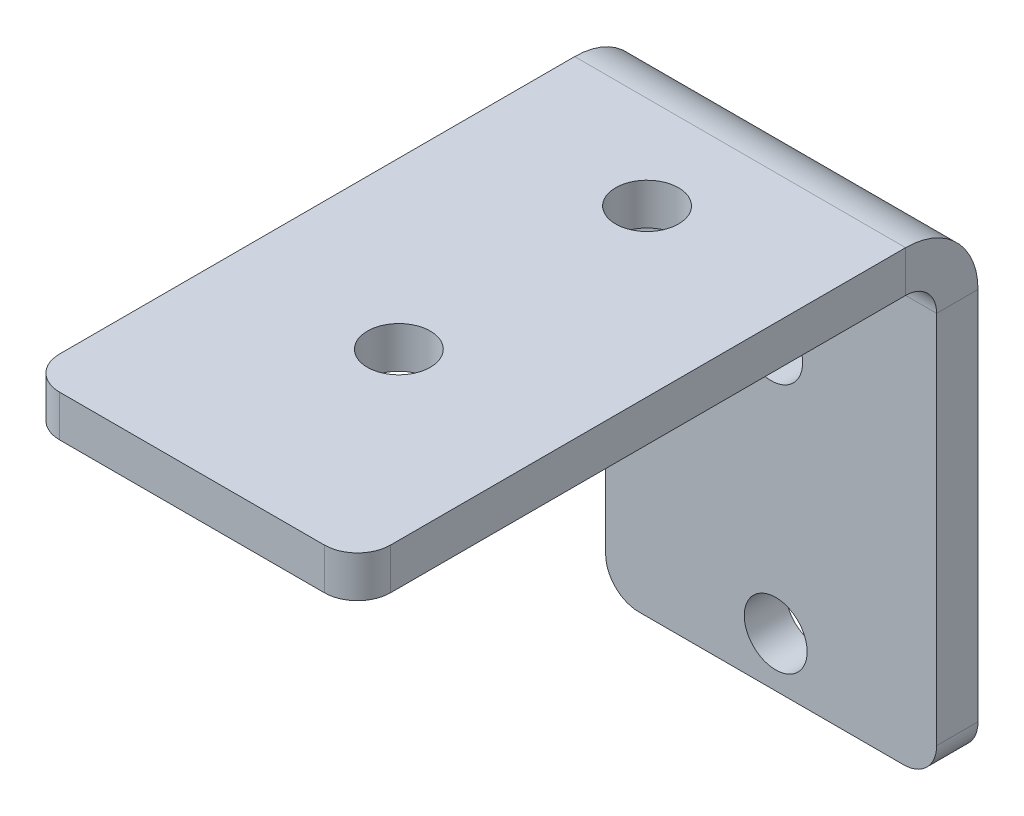
ISO-10303-21;
HEADER;
FILE_DESCRIPTION(('STEP AP214'),'2;1');
FILE_NAME('part.step','',(''),(''),'','','');
FILE_SCHEMA(('AUTOMOTIVE_DESIGN { 1 0 10303 214 1 1 1 1 }'));
ENDSEC;
DATA;
#1=APPLICATION_CONTEXT('core data for automotive mechanical design processes');
#2=APPLICATION_PROTOCOL_DEFINITION('international standard','automotive_design',2000,#1);
#3=PRODUCT_CONTEXT('',#1,'mechanical');
#4=PRODUCT('Part','Part','',(#3));
#5=PRODUCT_RELATED_PRODUCT_CATEGORY('part','',(#4));
#6=PRODUCT_DEFINITION_FORMATION('','',#4);
#7=PRODUCT_DEFINITION_CONTEXT('part definition',#1,'design');
#8=PRODUCT_DEFINITION('design','',#6,#7);
#9=PRODUCT_DEFINITION_SHAPE('','',#8);
#10=(LENGTH_UNIT() NAMED_UNIT(*) SI_UNIT(.MILLI.,.METRE.));
#11=(NAMED_UNIT(*) PLANE_ANGLE_UNIT() SI_UNIT($,.RADIAN.));
#12=(NAMED_UNIT(*) SI_UNIT($,.STERADIAN.) SOLID_ANGLE_UNIT());
#13=UNCERTAINTY_MEASURE_WITH_UNIT(LENGTH_MEASURE(1.E-05),#10,'distance_accuracy_value','');
#14=(GEOMETRIC_REPRESENTATION_CONTEXT(3) GLOBAL_UNCERTAINTY_ASSIGNED_CONTEXT((#13)) GLOBAL_UNIT_ASSIGNED_CONTEXT((#10,
#11,#12)) REPRESENTATION_CONTEXT('',''));
#15=CARTESIAN_POINT('',(0.,0.,0.));
#16=DIRECTION('',(0.,0.,1.));
#17=DIRECTION('',(1.,0.,0.));
#18=AXIS2_PLACEMENT_3D('',#15,#16,#17);
#19=CARTESIAN_POINT('',(12.7,15.24,47.625));
#20=DIRECTION('',(1.,0.,0.));
#21=DIRECTION('',(0.,0.,-1.));
#22=AXIS2_PLACEMENT_3D('',#19,#20,#21);
#23=PLANE('',#22);
#24=DIRECTION('',(0.,-1.,0.));
#25=VECTOR('',#24,1.);
#26=CARTESIAN_POINT('',(12.7,15.24,5.555000066));
#27=LINE('',#26,#25);
#28=CARTESIAN_POINT('',(12.7,18.415,5.555000066));
#29=VERTEX_POINT('',#28);
#30=CARTESIAN_POINT('',(12.7,15.24,5.555000066));
#31=VERTEX_POINT('',#30);
#32=EDGE_CURVE('E11',#29,#31,#27,.T.);
#33=ORIENTED_EDGE('',*,*,#32,.F.);
#34=DIRECTION('',(0.,0.,1.));
#35=VECTOR('',#34,1.);
#36=CARTESIAN_POINT('',(12.7,18.415,47.625));
#37=LINE('',#36,#35);
#38=CARTESIAN_POINT('',(12.7,18.415,45.085));
#39=VERTEX_POINT('',#38);
#40=EDGE_CURVE('E101',#39,#29,#37,.F.);
#41=ORIENTED_EDGE('',*,*,#40,.F.);
#42=DIRECTION('',(0.,-1.,0.));
#43=VECTOR('',#42,1.);
#44=CARTESIAN_POINT('',(12.7,15.24,45.085));
#45=LINE('',#44,#43);
#46=CARTESIAN_POINT('',(12.7,15.24,45.085));
#47=VERTEX_POINT('',#46);
#48=EDGE_CURVE('E49',#39,#47,#45,.T.);
#49=ORIENTED_EDGE('',*,*,#48,.T.);
#50=DIRECTION('',(0.,0.,-1.));
#51=VECTOR('',#50,1.);
#52=CARTESIAN_POINT('',(12.7,15.24,47.625));
#53=LINE('',#52,#51);
#54=EDGE_CURVE('E104',#47,#31,#53,.T.);
#55=ORIENTED_EDGE('',*,*,#54,.T.);
#56=EDGE_LOOP('',(#33,#41,#49,#55));
#57=FACE_BOUND('',#56,.T.);
#58=ADVANCED_FACE('F39',(#57),#23,.T.);
#59=CARTESIAN_POINT('',(10.16,15.24,45.085));
#60=DIRECTION('',(0.,1.,0.));
#61=DIRECTION('',(-1.,0.,0.));
#62=AXIS2_PLACEMENT_3D('',#59,#60,#61);
#63=CYLINDRICAL_SURFACE('',#62,2.54);
#64=ORIENTED_EDGE('',*,*,#48,.F.);
#65=CARTESIAN_POINT('',(10.16,18.415,45.085));
#66=DIRECTION('',(0.,1.,0.));
#67=DIRECTION('',(-1.,0.,0.));
#68=AXIS2_PLACEMENT_3D('',#65,#66,#67);
#69=CIRCLE('',#68,2.54);
#70=CARTESIAN_POINT('',(10.16,18.415,47.625));
#71=VERTEX_POINT('',#70);
#72=EDGE_CURVE('E130',#39,#71,#69,.F.);
#73=ORIENTED_EDGE('',*,*,#72,.T.);
#74=DIRECTION('',(0.,-1.,0.));
#75=VECTOR('',#74,1.);
#76=CARTESIAN_POINT('',(10.16,15.24,47.625));
#77=LINE('',#76,#75);
#78=CARTESIAN_POINT('',(10.16,15.24,47.625));
#79=VERTEX_POINT('',#78);
#80=EDGE_CURVE('E167',#71,#79,#77,.T.);
#81=ORIENTED_EDGE('',*,*,#80,.T.);
#82=CARTESIAN_POINT('',(10.16,15.24,45.085));
#83=DIRECTION('',(0.,1.,0.));
#84=DIRECTION('',(-1.,0.,0.));
#85=AXIS2_PLACEMENT_3D('',#82,#83,#84);
#86=CIRCLE('',#85,2.54);
#87=EDGE_CURVE('E179',#47,#79,#86,.F.);
#88=ORIENTED_EDGE('',*,*,#87,.F.);
#89=EDGE_LOOP('',(#64,#73,#81,#88));
#90=FACE_BOUND('',#89,.T.);
#91=ADVANCED_FACE('F185',(#90),#63,.T.);
#92=CARTESIAN_POINT('',(-12.7,15.24,47.625));
#93=DIRECTION('',(0.,0.,1.));
#94=DIRECTION('',(1.,0.,0.));
#95=AXIS2_PLACEMENT_3D('',#92,#93,#94);
#96=PLANE('',#95);
#97=ORIENTED_EDGE('',*,*,#80,.F.);
#98=DIRECTION('',(-1.,0.,0.));
#99=VECTOR('',#98,1.);
#100=CARTESIAN_POINT('',(-12.7,18.415,47.625));
#101=LINE('',#100,#99);
#102=CARTESIAN_POINT('',(-10.16,18.415,47.625));
#103=VERTEX_POINT('',#102);
#104=EDGE_CURVE('E251',#103,#71,#101,.F.);
#105=ORIENTED_EDGE('',*,*,#104,.F.);
#106=DIRECTION('',(0.,-1.,0.));
#107=VECTOR('',#106,1.);
#108=CARTESIAN_POINT('',(-10.16,15.24,47.625));
#109=LINE('',#108,#107);
#110=CARTESIAN_POINT('',(-10.16,15.24,47.625));
#111=VERTEX_POINT('',#110);
#112=EDGE_CURVE('E164',#103,#111,#109,.T.);
#113=ORIENTED_EDGE('',*,*,#112,.T.);
#114=DIRECTION('',(1.,0.,0.));
#115=VECTOR('',#114,1.);
#116=CARTESIAN_POINT('',(-12.7,15.24,47.625));
#117=LINE('',#116,#115);
#118=EDGE_CURVE('E186',#111,#79,#117,.T.);
#119=ORIENTED_EDGE('',*,*,#118,.T.);
#120=EDGE_LOOP('',(#97,#105,#113,#119));
#121=FACE_BOUND('',#120,.T.);
#122=ADVANCED_FACE('F255',(#121),#96,.T.);
#123=CARTESIAN_POINT('',(-10.16,15.24,45.085));
#124=DIRECTION('',(0.,1.,0.));
#125=DIRECTION('',(-1.,0.,0.));
#126=AXIS2_PLACEMENT_3D('',#123,#124,#125);
#127=CYLINDRICAL_SURFACE('',#126,2.54);
#128=ORIENTED_EDGE('',*,*,#112,.F.);
#129=CARTESIAN_POINT('',(-10.16,18.415,45.085));
#130=DIRECTION('',(0.,1.,0.));
#131=DIRECTION('',(-1.,0.,0.));
#132=AXIS2_PLACEMENT_3D('',#129,#130,#131);
#133=CIRCLE('',#132,2.54);
#134=CARTESIAN_POINT('',(-12.7,18.415,45.085));
#135=VERTEX_POINT('',#134);
#136=EDGE_CURVE('E248',#103,#135,#133,.F.);
#137=ORIENTED_EDGE('',*,*,#136,.T.);
#138=DIRECTION('',(0.,-1.,0.));
#139=VECTOR('',#138,1.);
#140=CARTESIAN_POINT('',(-12.7,15.24,45.085));
#141=LINE('',#140,#139);
#142=CARTESIAN_POINT('',(-12.7,15.24,45.085));
#143=VERTEX_POINT('',#142);
#144=EDGE_CURVE('E161',#135,#143,#141,.T.);
#145=ORIENTED_EDGE('',*,*,#144,.T.);
#146=CARTESIAN_POINT('',(-10.16,15.24,45.085));
#147=DIRECTION('',(0.,1.,0.));
#148=DIRECTION('',(-1.,0.,0.));
#149=AXIS2_PLACEMENT_3D('',#146,#147,#148);
#150=CIRCLE('',#149,2.54);
#151=EDGE_CURVE('E188',#111,#143,#150,.F.);
#152=ORIENTED_EDGE('',*,*,#151,.F.);
#153=EDGE_LOOP('',(#128,#137,#145,#152));
#154=FACE_BOUND('',#153,.T.);
#155=ADVANCED_FACE('F263',(#154),#127,.T.);
#156=CARTESIAN_POINT('',(-12.7,15.24,47.625));
#157=DIRECTION('',(1.,0.,0.));
#158=DIRECTION('',(0.,0.,-1.));
#159=AXIS2_PLACEMENT_3D('',#156,#157,#158);
#160=PLANE('',#159);
#161=ORIENTED_EDGE('',*,*,#144,.F.);
#162=DIRECTION('',(0.,0.,1.));
#163=VECTOR('',#162,1.);
#164=CARTESIAN_POINT('',(-12.7,18.415,47.625));
#165=LINE('',#164,#163);
#166=CARTESIAN_POINT('',(-12.7,18.415,5.555000066));
#167=VERTEX_POINT('',#166);
#168=EDGE_CURVE('E231',#135,#167,#165,.F.);
#169=ORIENTED_EDGE('',*,*,#168,.T.);
#170=DIRECTION('',(0.,-1.,0.));
#171=VECTOR('',#170,1.);
#172=CARTESIAN_POINT('',(-12.7,15.24,5.555000066));
#173=LINE('',#172,#171);
#174=CARTESIAN_POINT('',(-12.7,15.24,5.555000066));
#175=VERTEX_POINT('',#174);
#176=EDGE_CURVE('E158',#167,#175,#173,.T.);
#177=ORIENTED_EDGE('',*,*,#176,.T.);
#178=DIRECTION('',(0.,0.,-1.));
#179=VECTOR('',#178,1.);
#180=CARTESIAN_POINT('',(-12.7,15.24,47.625));
#181=LINE('',#180,#179);
#182=EDGE_CURVE('E194',#143,#175,#181,.T.);
#183=ORIENTED_EDGE('',*,*,#182,.F.);
#184=EDGE_LOOP('',(#161,#169,#177,#183));
#185=FACE_BOUND('',#184,.T.);
#186=ADVANCED_FACE('F267',(#185),#160,.F.);
#187=CARTESIAN_POINT('',(-12.7,12.859999934,5.555000066));
#188=DIRECTION('',(-1.,0.,0.));
#189=DIRECTION('',(0.,0.,1.));
#190=AXIS2_PLACEMENT_3D('',#187,#188,#189);
#191=PLANE('',#190);
#192=ORIENTED_EDGE('',*,*,#176,.F.);
#193=CARTESIAN_POINT('',(-12.7,12.859999934,5.555000066));
#194=DIRECTION('',(-1.,0.,0.));
#195=DIRECTION('',(0.,-1.,0.));
#196=AXIS2_PLACEMENT_3D('',#193,#194,#195);
#197=CIRCLE('',#196,5.555000066);
#198=CARTESIAN_POINT('',(-12.7,12.859999934,0.));
#199=VERTEX_POINT('',#198);
#200=EDGE_CURVE('E119',#167,#199,#197,.T.);
#201=ORIENTED_EDGE('',*,*,#200,.T.);
#202=DIRECTION('',(0.,0.,1.));
#203=VECTOR('',#202,1.);
#204=CARTESIAN_POINT('',(-12.7,12.859999934,3.175));
#205=LINE('',#204,#203);
#206=CARTESIAN_POINT('',(-12.7,12.859999934,3.175));
#207=VERTEX_POINT('',#206);
#208=EDGE_CURVE('E57',#199,#207,#205,.T.);
#209=ORIENTED_EDGE('',*,*,#208,.T.);
#210=CARTESIAN_POINT('',(-12.7,12.859999934,5.555000066));
#211=DIRECTION('',(1.,0.,0.));
#212=DIRECTION('',(0.,0.,-1.));
#213=AXIS2_PLACEMENT_3D('',#210,#211,#212);
#214=CIRCLE('',#213,2.380000066);
#215=EDGE_CURVE('E223',#175,#207,#214,.F.);
#216=ORIENTED_EDGE('',*,*,#215,.F.);
#217=EDGE_LOOP('',(#192,#201,#209,#216));
#218=FACE_BOUND('',#217,.T.);
#219=ADVANCED_FACE('F268',(#218),#191,.T.);
#220=CARTESIAN_POINT('',(-12.7,-18.415,3.175));
#221=DIRECTION('',(1.,0.,0.));
#222=DIRECTION('',(0.,-1.,0.));
#223=AXIS2_PLACEMENT_3D('',#220,#221,#222);
#224=PLANE('',#223);
#225=ORIENTED_EDGE('',*,*,#208,.F.);
#226=DIRECTION('',(0.,1.,0.));
#227=VECTOR('',#226,1.);
#228=CARTESIAN_POINT('',(-12.7,0.,0.));
#229=LINE('',#228,#227);
#230=CARTESIAN_POINT('',(-12.7,-15.875,0.));
#231=VERTEX_POINT('',#230);
#232=EDGE_CURVE('E237',#199,#231,#229,.F.);
#233=ORIENTED_EDGE('',*,*,#232,.T.);
#234=DIRECTION('',(0.,0.,1.));
#235=VECTOR('',#234,1.);
#236=CARTESIAN_POINT('',(-12.7,-15.875,3.175));
#237=LINE('',#236,#235);
#238=CARTESIAN_POINT('',(-12.7,-15.875,3.175));
#239=VERTEX_POINT('',#238);
#240=EDGE_CURVE('E154',#231,#239,#237,.T.);
#241=ORIENTED_EDGE('',*,*,#240,.T.);
#242=DIRECTION('',(0.,-1.,0.));
#243=VECTOR('',#242,1.);
#244=CARTESIAN_POINT('',(-12.7,-18.415,3.175));
#245=LINE('',#244,#243);
#246=EDGE_CURVE('E211',#207,#239,#245,.T.);
#247=ORIENTED_EDGE('',*,*,#246,.F.);
#248=EDGE_LOOP('',(#225,#233,#241,#247));
#249=FACE_BOUND('',#248,.T.);
#250=ADVANCED_FACE('F301',(#249),#224,.F.);
#251=CARTESIAN_POINT('',(-10.16,-15.875,3.175));
#252=DIRECTION('',(0.,0.,-1.));
#253=DIRECTION('',(-1.,0.,0.));
#254=AXIS2_PLACEMENT_3D('',#251,#252,#253);
#255=CYLINDRICAL_SURFACE('',#254,2.54);
#256=ORIENTED_EDGE('',*,*,#240,.F.);
#257=CARTESIAN_POINT('',(-10.16,-15.875,0.));
#258=DIRECTION('',(0.,0.,-1.));
#259=DIRECTION('',(-1.,0.,0.));
#260=AXIS2_PLACEMENT_3D('',#257,#258,#259);
#261=CIRCLE('',#260,2.54);
#262=CARTESIAN_POINT('',(-10.16,-18.415,0.));
#263=VERTEX_POINT('',#262);
#264=EDGE_CURVE('E124',#231,#263,#261,.F.);
#265=ORIENTED_EDGE('',*,*,#264,.T.);
#266=DIRECTION('',(0.,0.,1.));
#267=VECTOR('',#266,1.);
#268=CARTESIAN_POINT('',(-10.16,-18.415,3.175));
#269=LINE('',#268,#267);
#270=CARTESIAN_POINT('',(-10.16,-18.415,3.175));
#271=VERTEX_POINT('',#270);
#272=EDGE_CURVE('E151',#263,#271,#269,.T.);
#273=ORIENTED_EDGE('',*,*,#272,.T.);
#274=CARTESIAN_POINT('',(-10.16,-15.875,3.175));
#275=DIRECTION('',(0.,0.,-1.));
#276=DIRECTION('',(-1.,0.,0.));
#277=AXIS2_PLACEMENT_3D('',#274,#275,#276);
#278=CIRCLE('',#277,2.54);
#279=EDGE_CURVE('E214',#239,#271,#278,.F.);
#280=ORIENTED_EDGE('',*,*,#279,.F.);
#281=EDGE_LOOP('',(#256,#265,#273,#280));
#282=FACE_BOUND('',#281,.T.);
#283=ADVANCED_FACE('F303',(#282),#255,.T.);
#284=CARTESIAN_POINT('',(-12.7,-18.415,3.175));
#285=DIRECTION('',(0.,1.,0.));
#286=DIRECTION('',(1.,0.,0.));
#287=AXIS2_PLACEMENT_3D('',#284,#285,#286);
#288=PLANE('',#287);
#289=ORIENTED_EDGE('',*,*,#272,.F.);
#290=DIRECTION('',(-1.,0.,0.));
#291=VECTOR('',#290,1.);
#292=CARTESIAN_POINT('',(0.,-18.415,0.));
#293=LINE('',#292,#291);
#294=CARTESIAN_POINT('',(10.16,-18.415,0.));
#295=VERTEX_POINT('',#294);
#296=EDGE_CURVE('E234',#263,#295,#293,.F.);
#297=ORIENTED_EDGE('',*,*,#296,.T.);
#298=DIRECTION('',(0.,0.,1.));
#299=VECTOR('',#298,1.);
#300=CARTESIAN_POINT('',(10.16,-18.415,3.175));
#301=LINE('',#300,#299);
#302=CARTESIAN_POINT('',(10.16,-18.415,3.175));
#303=VERTEX_POINT('',#302);
#304=EDGE_CURVE('E148',#295,#303,#301,.T.);
#305=ORIENTED_EDGE('',*,*,#304,.T.);
#306=DIRECTION('',(1.,0.,0.));
#307=VECTOR('',#306,1.);
#308=CARTESIAN_POINT('',(-12.7,-18.415,3.175));
#309=LINE('',#308,#307);
#310=EDGE_CURVE('E202',#271,#303,#309,.T.);
#311=ORIENTED_EDGE('',*,*,#310,.F.);
#312=EDGE_LOOP('',(#289,#297,#305,#311));
#313=FACE_BOUND('',#312,.T.);
#314=ADVANCED_FACE('F283',(#313),#288,.F.);
#315=CARTESIAN_POINT('',(10.16,-15.875,3.175));
#316=DIRECTION('',(0.,0.,-1.));
#317=DIRECTION('',(-1.,0.,0.));
#318=AXIS2_PLACEMENT_3D('',#315,#316,#317);
#319=CYLINDRICAL_SURFACE('',#318,2.54);
#320=ORIENTED_EDGE('',*,*,#304,.F.);
#321=CARTESIAN_POINT('',(10.16,-15.875,0.));
#322=DIRECTION('',(0.,0.,-1.));
#323=DIRECTION('',(-1.,0.,0.));
#324=AXIS2_PLACEMENT_3D('',#321,#322,#323);
#325=CIRCLE('',#324,2.54);
#326=CARTESIAN_POINT('',(12.7,-15.875,0.));
#327=VERTEX_POINT('',#326);
#328=EDGE_CURVE('E238',#295,#327,#325,.F.);
#329=ORIENTED_EDGE('',*,*,#328,.T.);
#330=DIRECTION('',(0.,0.,1.));
#331=VECTOR('',#330,1.);
#332=CARTESIAN_POINT('',(12.7,-15.875,3.175));
#333=LINE('',#332,#331);
#334=CARTESIAN_POINT('',(12.7,-15.875,3.175));
#335=VERTEX_POINT('',#334);
#336=EDGE_CURVE('E145',#327,#335,#333,.T.);
#337=ORIENTED_EDGE('',*,*,#336,.T.);
#338=CARTESIAN_POINT('',(10.16,-15.875,3.175));
#339=DIRECTION('',(0.,0.,-1.));
#340=DIRECTION('',(-1.,0.,0.));
#341=AXIS2_PLACEMENT_3D('',#338,#339,#340);
#342=CIRCLE('',#341,2.54);
#343=EDGE_CURVE('E205',#303,#335,#342,.F.);
#344=ORIENTED_EDGE('',*,*,#343,.F.);
#345=EDGE_LOOP('',(#320,#329,#337,#344));
#346=FACE_BOUND('',#345,.T.);
#347=ADVANCED_FACE('F292',(#346),#319,.T.);
#348=CARTESIAN_POINT('',(12.7,-18.415,3.175));
#349=DIRECTION('',(-1.,0.,0.));
#350=DIRECTION('',(0.,1.,0.));
#351=AXIS2_PLACEMENT_3D('',#348,#349,#350);
#352=PLANE('',#351);
#353=ORIENTED_EDGE('',*,*,#336,.F.);
#354=DIRECTION('',(0.,1.,0.));
#355=VECTOR('',#354,1.);
#356=CARTESIAN_POINT('',(12.7,0.,0.));
#357=LINE('',#356,#355);
#358=CARTESIAN_POINT('',(12.7,12.859999934,0.));
#359=VERTEX_POINT('',#358);
#360=EDGE_CURVE('E235',#327,#359,#357,.T.);
#361=ORIENTED_EDGE('',*,*,#360,.T.);
#362=DIRECTION('',(0.,0.,1.));
#363=VECTOR('',#362,1.);
#364=CARTESIAN_POINT('',(12.7,12.859999934,3.175));
#365=LINE('',#364,#363);
#366=CARTESIAN_POINT('',(12.7,12.859999934,3.175));
#367=VERTEX_POINT('',#366);
#368=EDGE_CURVE('E43',#359,#367,#365,.T.);
#369=ORIENTED_EDGE('',*,*,#368,.T.);
#370=DIRECTION('',(0.,1.,0.));
#371=VECTOR('',#370,1.);
#372=CARTESIAN_POINT('',(12.7,-18.415,3.175));
#373=LINE('',#372,#371);
#374=EDGE_CURVE('E208',#335,#367,#373,.T.);
#375=ORIENTED_EDGE('',*,*,#374,.F.);
#376=EDGE_LOOP('',(#353,#361,#369,#375));
#377=FACE_BOUND('',#376,.T.);
#378=ADVANCED_FACE('F295',(#377),#352,.F.);
#379=CARTESIAN_POINT('',(0.,15.24,12.7));
#380=DIRECTION('',(0.,1.,0.));
#381=DIRECTION('',(-1.,0.,0.));
#382=AXIS2_PLACEMENT_3D('',#379,#380,#381);
#383=CYLINDRICAL_SURFACE('',#382,2.413);
#384=CARTESIAN_POINT('',(0.,15.24,12.7));
#385=DIRECTION('',(0.,1.,0.));
#386=DIRECTION('',(-1.,0.,0.));
#387=AXIS2_PLACEMENT_3D('',#384,#385,#386);
#388=CIRCLE('',#387,2.413);
#389=CARTESIAN_POINT('',(-2.413,15.24,12.7));
#390=VERTEX_POINT('',#389);
#391=EDGE_CURVE('E225',#390,#390,#388,.T.);
#392=ORIENTED_EDGE('',*,*,#391,.F.);
#393=EDGE_LOOP('',(#392));
#394=FACE_BOUND('',#393,.T.);
#395=CARTESIAN_POINT('',(0.,18.415,12.7));
#396=DIRECTION('',(0.,1.,0.));
#397=DIRECTION('',(-1.,0.,0.));
#398=AXIS2_PLACEMENT_3D('',#395,#396,#397);
#399=CIRCLE('',#398,2.413);
#400=CARTESIAN_POINT('',(-2.413,18.415,12.7));
#401=VERTEX_POINT('',#400);
#402=EDGE_CURVE('E137',#401,#401,#399,.T.);
#403=ORIENTED_EDGE('',*,*,#402,.T.);
#404=EDGE_LOOP('',(#403));
#405=FACE_BOUND('',#404,.T.);
#406=ADVANCED_FACE('F322',(#394,#405),#383,.F.);
#407=CARTESIAN_POINT('',(0.,15.24,31.75));
#408=DIRECTION('',(0.,1.,0.));
#409=DIRECTION('',(-1.,0.,0.));
#410=AXIS2_PLACEMENT_3D('',#407,#408,#409);
#411=CYLINDRICAL_SURFACE('',#410,2.413);
#412=CARTESIAN_POINT('',(0.,15.24,31.75));
#413=DIRECTION('',(0.,1.,0.));
#414=DIRECTION('',(-1.,0.,0.));
#415=AXIS2_PLACEMENT_3D('',#412,#413,#414);
#416=CIRCLE('',#415,2.413);
#417=CARTESIAN_POINT('',(-2.413,15.24,31.75));
#418=VERTEX_POINT('',#417);
#419=EDGE_CURVE('E183',#418,#418,#416,.T.);
#420=ORIENTED_EDGE('',*,*,#419,.F.);
#421=EDGE_LOOP('',(#420));
#422=FACE_BOUND('',#421,.T.);
#423=CARTESIAN_POINT('',(0.,18.415,31.75));
#424=DIRECTION('',(0.,1.,0.));
#425=DIRECTION('',(-1.,0.,0.));
#426=AXIS2_PLACEMENT_3D('',#423,#424,#425);
#427=CIRCLE('',#426,2.413);
#428=CARTESIAN_POINT('',(-2.413,18.415,31.75));
#429=VERTEX_POINT('',#428);
#430=EDGE_CURVE('E131',#429,#429,#427,.T.);
#431=ORIENTED_EDGE('',*,*,#430,.T.);
#432=EDGE_LOOP('',(#431));
#433=FACE_BOUND('',#432,.T.);
#434=ADVANCED_FACE('F41',(#422,#433),#411,.F.);
#435=CARTESIAN_POINT('',(0.348627450980394,-14.605,3.175));
#436=DIRECTION('',(0.,0.,-1.));
#437=DIRECTION('',(-1.,0.,0.));
#438=AXIS2_PLACEMENT_3D('',#435,#436,#437);
#439=CYLINDRICAL_SURFACE('',#438,2.413);
#440=CARTESIAN_POINT('',(0.348627450980394,-14.605,3.175));
#441=DIRECTION('',(0.,0.,1.));
#442=DIRECTION('',(1.,0.,0.));
#443=AXIS2_PLACEMENT_3D('',#440,#441,#442);
#444=CIRCLE('',#443,2.413);
#445=CARTESIAN_POINT('',(2.76162745098039,-14.605,3.175));
#446=VERTEX_POINT('',#445);
#447=EDGE_CURVE('E196',#446,#446,#444,.T.);
#448=ORIENTED_EDGE('',*,*,#447,.T.);
#449=EDGE_LOOP('',(#448));
#450=FACE_BOUND('',#449,.T.);
#451=CARTESIAN_POINT('',(0.348627450980394,-14.605,0.));
#452=DIRECTION('',(0.,0.,1.));
#453=DIRECTION('',(1.,0.,0.));
#454=AXIS2_PLACEMENT_3D('',#451,#452,#453);
#455=CIRCLE('',#454,2.413);
#456=CARTESIAN_POINT('',(2.76162745098039,-14.605,0.));
#457=VERTEX_POINT('',#456);
#458=EDGE_CURVE('E227',#457,#457,#455,.T.);
#459=ORIENTED_EDGE('',*,*,#458,.F.);
#460=EDGE_LOOP('',(#459));
#461=FACE_BOUND('',#460,.T.);
#462=ADVANCED_FACE('F329',(#450,#461),#439,.F.);
#463=CARTESIAN_POINT('',(0.,4.445,3.175));
#464=DIRECTION('',(0.,0.,-1.));
#465=DIRECTION('',(-1.,0.,0.));
#466=AXIS2_PLACEMENT_3D('',#463,#464,#465);
#467=CYLINDRICAL_SURFACE('',#466,2.413);
#468=CARTESIAN_POINT('',(0.,4.445,3.175));
#469=DIRECTION('',(0.,0.,1.));
#470=DIRECTION('',(1.,0.,0.));
#471=AXIS2_PLACEMENT_3D('',#468,#469,#470);
#472=CIRCLE('',#471,2.413);
#473=CARTESIAN_POINT('',(2.413,4.445,3.175));
#474=VERTEX_POINT('',#473);
#475=EDGE_CURVE('E199',#474,#474,#472,.T.);
#476=ORIENTED_EDGE('',*,*,#475,.T.);
#477=EDGE_LOOP('',(#476));
#478=FACE_BOUND('',#477,.T.);
#479=CARTESIAN_POINT('',(0.,4.445,0.));
#480=DIRECTION('',(0.,0.,1.));
#481=DIRECTION('',(1.,0.,0.));
#482=AXIS2_PLACEMENT_3D('',#479,#480,#481);
#483=CIRCLE('',#482,2.413);
#484=CARTESIAN_POINT('',(2.413,4.445,0.));
#485=VERTEX_POINT('',#484);
#486=EDGE_CURVE('E230',#485,#485,#483,.T.);
#487=ORIENTED_EDGE('',*,*,#486,.F.);
#488=EDGE_LOOP('',(#487));
#489=FACE_BOUND('',#488,.T.);
#490=ADVANCED_FACE('F321',(#478,#489),#467,.F.);
#491=CARTESIAN_POINT('',(12.7,12.859999934,5.555000066));
#492=DIRECTION('',(-1.,0.,0.));
#493=DIRECTION('',(0.,0.,1.));
#494=AXIS2_PLACEMENT_3D('',#491,#492,#493);
#495=PLANE('',#494);
#496=CARTESIAN_POINT('',(12.7,12.859999934,5.555000066));
#497=DIRECTION('',(-1.,0.,0.));
#498=DIRECTION('',(0.,-1.,0.));
#499=AXIS2_PLACEMENT_3D('',#496,#497,#498);
#500=CIRCLE('',#499,5.555000066);
#501=EDGE_CURVE('E117',#359,#29,#500,.F.);
#502=ORIENTED_EDGE('',*,*,#501,.T.);
#503=ORIENTED_EDGE('',*,*,#32,.T.);
#504=CARTESIAN_POINT('',(12.7,12.859999934,5.555000066));
#505=DIRECTION('',(1.,0.,0.));
#506=DIRECTION('',(0.,0.,-1.));
#507=AXIS2_PLACEMENT_3D('',#504,#505,#506);
#508=CIRCLE('',#507,2.380000066);
#509=EDGE_CURVE('E221',#367,#31,#508,.T.);
#510=ORIENTED_EDGE('',*,*,#509,.F.);
#511=ORIENTED_EDGE('',*,*,#368,.F.);
#512=EDGE_LOOP('',(#502,#503,#510,#511));
#513=FACE_BOUND('',#512,.T.);
#514=ADVANCED_FACE('F134',(#513),#495,.F.);
#515=CARTESIAN_POINT('',(0.,0.,3.175));
#516=DIRECTION('',(0.,0.,-1.));
#517=DIRECTION('',(-1.,0.,0.));
#518=AXIS2_PLACEMENT_3D('',#515,#516,#517);
#519=PLANE('',#518);
#520=ORIENTED_EDGE('',*,*,#447,.F.);
#521=EDGE_LOOP('',(#520));
#522=FACE_BOUND('',#521,.T.);
#523=ORIENTED_EDGE('',*,*,#475,.F.);
#524=EDGE_LOOP('',(#523));
#525=FACE_BOUND('',#524,.T.);
#526=ORIENTED_EDGE('',*,*,#374,.T.);
#527=DIRECTION('',(1.,0.,0.));
#528=VECTOR('',#527,1.);
#529=CARTESIAN_POINT('',(-12.7,12.859999934,3.175));
#530=LINE('',#529,#528);
#531=EDGE_CURVE('E218',#367,#207,#530,.F.);
#532=ORIENTED_EDGE('',*,*,#531,.T.);
#533=ORIENTED_EDGE('',*,*,#246,.T.);
#534=ORIENTED_EDGE('',*,*,#279,.T.);
#535=ORIENTED_EDGE('',*,*,#310,.T.);
#536=ORIENTED_EDGE('',*,*,#343,.T.);
#537=EDGE_LOOP('',(#526,#532,#533,#534,#535,#536));
#538=FACE_BOUND('',#537,.T.);
#539=ADVANCED_FACE('F289',(#522,#525,#538),#519,.F.);
#540=CARTESIAN_POINT('',(-12.7,15.24,47.625));
#541=DIRECTION('',(0.,1.,0.));
#542=DIRECTION('',(-1.,0.,0.));
#543=AXIS2_PLACEMENT_3D('',#540,#541,#542);
#544=PLANE('',#543);
#545=ORIENTED_EDGE('',*,*,#391,.T.);
#546=EDGE_LOOP('',(#545));
#547=FACE_BOUND('',#546,.T.);
#548=ORIENTED_EDGE('',*,*,#419,.T.);
#549=EDGE_LOOP('',(#548));
#550=FACE_BOUND('',#549,.T.);
#551=ORIENTED_EDGE('',*,*,#182,.T.);
#552=DIRECTION('',(1.,0.,0.));
#553=VECTOR('',#552,1.);
#554=CARTESIAN_POINT('',(12.7,15.24,5.555000066));
#555=LINE('',#554,#553);
#556=EDGE_CURVE('E182',#175,#31,#555,.T.);
#557=ORIENTED_EDGE('',*,*,#556,.T.);
#558=ORIENTED_EDGE('',*,*,#54,.F.);
#559=ORIENTED_EDGE('',*,*,#87,.T.);
#560=ORIENTED_EDGE('',*,*,#118,.F.);
#561=ORIENTED_EDGE('',*,*,#151,.T.);
#562=EDGE_LOOP('',(#551,#557,#558,#559,#560,#561));
#563=FACE_BOUND('',#562,.T.);
#564=ADVANCED_FACE('F177',(#547,#550,#563),#544,.F.);
#565=CARTESIAN_POINT('',(-12.7,12.859999934,5.555000066));
#566=DIRECTION('',(-1.,0.,0.));
#567=DIRECTION('',(0.,-1.,0.));
#568=AXIS2_PLACEMENT_3D('',#565,#566,#567);
#569=CYLINDRICAL_SURFACE('',#568,2.380000066);
#570=ORIENTED_EDGE('',*,*,#215,.T.);
#571=ORIENTED_EDGE('',*,*,#531,.F.);
#572=ORIENTED_EDGE('',*,*,#509,.T.);
#573=ORIENTED_EDGE('',*,*,#556,.F.);
#574=EDGE_LOOP('',(#570,#571,#572,#573));
#575=FACE_BOUND('',#574,.T.);
#576=ADVANCED_FACE('F272',(#575),#569,.F.);
#577=CARTESIAN_POINT('',(0.,0.,0.));
#578=DIRECTION('',(0.,0.,-1.));
#579=DIRECTION('',(-1.,0.,0.));
#580=AXIS2_PLACEMENT_3D('',#577,#578,#579);
#581=PLANE('',#580);
#582=ORIENTED_EDGE('',*,*,#458,.T.);
#583=EDGE_LOOP('',(#582));
#584=FACE_BOUND('',#583,.T.);
#585=ORIENTED_EDGE('',*,*,#486,.T.);
#586=EDGE_LOOP('',(#585));
#587=FACE_BOUND('',#586,.T.);
#588=ORIENTED_EDGE('',*,*,#360,.F.);
#589=ORIENTED_EDGE('',*,*,#328,.F.);
#590=ORIENTED_EDGE('',*,*,#296,.F.);
#591=ORIENTED_EDGE('',*,*,#264,.F.);
#592=ORIENTED_EDGE('',*,*,#232,.F.);
#593=DIRECTION('',(-1.,0.,0.));
#594=VECTOR('',#593,1.);
#595=CARTESIAN_POINT('',(0.,12.859999934,0.));
#596=LINE('',#595,#594);
#597=EDGE_CURVE('E123',#359,#199,#596,.T.);
#598=ORIENTED_EDGE('',*,*,#597,.F.);
#599=EDGE_LOOP('',(#588,#589,#590,#591,#592,#598));
#600=FACE_BOUND('',#599,.T.);
#601=ADVANCED_FACE('F297',(#584,#587,#600),#581,.T.);
#602=CARTESIAN_POINT('',(-12.7,18.415,47.625));
#603=DIRECTION('',(0.,1.,0.));
#604=DIRECTION('',(-1.,0.,0.));
#605=AXIS2_PLACEMENT_3D('',#602,#603,#604);
#606=PLANE('',#605);
#607=ORIENTED_EDGE('',*,*,#402,.F.);
#608=EDGE_LOOP('',(#607));
#609=FACE_BOUND('',#608,.T.);
#610=ORIENTED_EDGE('',*,*,#430,.F.);
#611=EDGE_LOOP('',(#610));
#612=FACE_BOUND('',#611,.T.);
#613=ORIENTED_EDGE('',*,*,#168,.F.);
#614=ORIENTED_EDGE('',*,*,#136,.F.);
#615=ORIENTED_EDGE('',*,*,#104,.T.);
#616=ORIENTED_EDGE('',*,*,#72,.F.);
#617=ORIENTED_EDGE('',*,*,#40,.T.);
#618=DIRECTION('',(-1.,0.,0.));
#619=VECTOR('',#618,1.);
#620=CARTESIAN_POINT('',(-12.7,18.415,5.555000066));
#621=LINE('',#620,#619);
#622=EDGE_CURVE('E114',#167,#29,#621,.F.);
#623=ORIENTED_EDGE('',*,*,#622,.F.);
#624=EDGE_LOOP('',(#613,#614,#615,#616,#617,#623));
#625=FACE_BOUND('',#624,.T.);
#626=ADVANCED_FACE('F127',(#609,#612,#625),#606,.T.);
#627=CARTESIAN_POINT('',(-12.7,12.859999934,5.555000066));
#628=DIRECTION('',(-1.,0.,0.));
#629=DIRECTION('',(0.,-1.,0.));
#630=AXIS2_PLACEMENT_3D('',#627,#628,#629);
#631=CYLINDRICAL_SURFACE('',#630,5.555000066);
#632=ORIENTED_EDGE('',*,*,#200,.F.);
#633=ORIENTED_EDGE('',*,*,#622,.T.);
#634=ORIENTED_EDGE('',*,*,#501,.F.);
#635=ORIENTED_EDGE('',*,*,#597,.T.);
#636=EDGE_LOOP('',(#632,#633,#634,#635));
#637=FACE_BOUND('',#636,.T.);
#638=ADVANCED_FACE('F115',(#637),#631,.T.);
#639=CLOSED_SHELL('',(#58,#91,#122,#155,#186,#219,#250,#283,#314,#347,#378,#406,#434,#462,#490,
#514,#539,#564,#576,#601,#626,#638));
#640=MANIFOLD_SOLID_BREP('B2',#639);
#641=ADVANCED_BREP_SHAPE_REPRESENTATION('',(#18,#640),#14);
#642=SHAPE_DEFINITION_REPRESENTATION(#9,#641);
ENDSEC;
END-ISO-10303-21;
